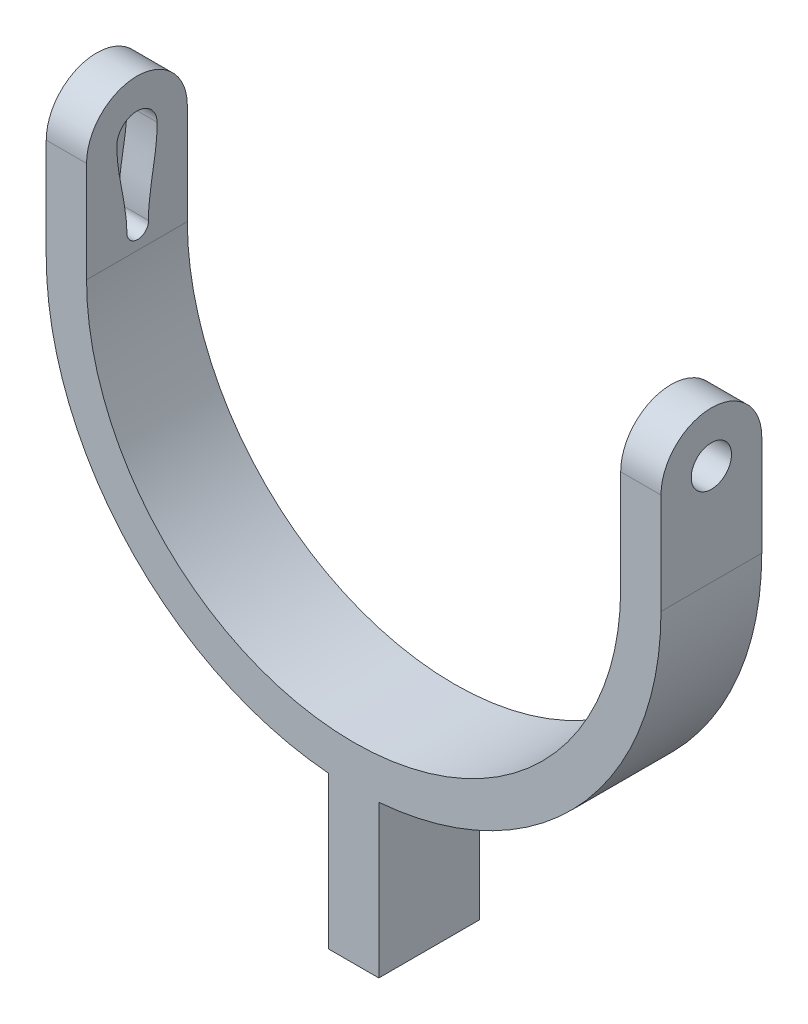
ISO-10303-21;
HEADER;
FILE_DESCRIPTION(('STEP AP214'),'2;1');
FILE_NAME('part.step','',(''),(''),'','','');
FILE_SCHEMA(('AUTOMOTIVE_DESIGN { 1 0 10303 214 1 1 1 1 }'));
ENDSEC;
DATA;
#1=APPLICATION_CONTEXT('core data for automotive mechanical design processes');
#2=APPLICATION_PROTOCOL_DEFINITION('international standard','automotive_design',2000,#1);
#3=PRODUCT_CONTEXT('',#1,'mechanical');
#4=PRODUCT('Part','Part','',(#3));
#5=PRODUCT_RELATED_PRODUCT_CATEGORY('part','',(#4));
#6=PRODUCT_DEFINITION_FORMATION('','',#4);
#7=PRODUCT_DEFINITION_CONTEXT('part definition',#1,'design');
#8=PRODUCT_DEFINITION('design','',#6,#7);
#9=PRODUCT_DEFINITION_SHAPE('','',#8);
#10=(LENGTH_UNIT() NAMED_UNIT(*) SI_UNIT(.MILLI.,.METRE.));
#11=(NAMED_UNIT(*) PLANE_ANGLE_UNIT() SI_UNIT($,.RADIAN.));
#12=(NAMED_UNIT(*) SI_UNIT($,.STERADIAN.) SOLID_ANGLE_UNIT());
#13=UNCERTAINTY_MEASURE_WITH_UNIT(LENGTH_MEASURE(1.E-05),#10,'distance_accuracy_value','');
#14=(GEOMETRIC_REPRESENTATION_CONTEXT(3) GLOBAL_UNCERTAINTY_ASSIGNED_CONTEXT((#13)) GLOBAL_UNIT_ASSIGNED_CONTEXT((#10,
#11,#12)) REPRESENTATION_CONTEXT('',''));
#15=CARTESIAN_POINT('',(0.,0.,0.));
#16=DIRECTION('',(0.,0.,1.));
#17=DIRECTION('',(1.,0.,0.));
#18=AXIS2_PLACEMENT_3D('',#15,#16,#17);
#19=CARTESIAN_POINT('',(-26.5,0.,10.));
#20=DIRECTION('',(-1.,0.,0.));
#21=DIRECTION('',(0.,0.,1.));
#22=AXIS2_PLACEMENT_3D('',#19,#20,#21);
#23=PLANE('',#22);
#24=DIRECTION('',(0.,1.,0.));
#25=VECTOR('',#24,1.);
#26=CARTESIAN_POINT('',(-26.5,0.,0.));
#27=LINE('',#26,#25);
#28=CARTESIAN_POINT('',(-26.5,0.,0.));
#29=VERTEX_POINT('',#28);
#30=CARTESIAN_POINT('',(-26.5,10.,0.));
#31=VERTEX_POINT('',#30);
#32=EDGE_CURVE('E182',#29,#31,#27,.T.);
#33=ORIENTED_EDGE('',*,*,#32,.T.);
#34=CARTESIAN_POINT('',(-26.5,10.,5.));
#35=DIRECTION('',(-1.,0.,0.));
#36=DIRECTION('',(0.,0.,1.));
#37=AXIS2_PLACEMENT_3D('',#34,#35,#36);
#38=CIRCLE('',#37,5.);
#39=CARTESIAN_POINT('',(-26.5,10.,10.));
#40=VERTEX_POINT('',#39);
#41=EDGE_CURVE('E98',#40,#31,#38,.T.);
#42=ORIENTED_EDGE('',*,*,#41,.F.);
#43=DIRECTION('',(0.,1.,0.));
#44=VECTOR('',#43,1.);
#45=CARTESIAN_POINT('',(-26.5,0.,10.));
#46=LINE('',#45,#44);
#47=CARTESIAN_POINT('',(-26.5,0.,10.));
#48=VERTEX_POINT('',#47);
#49=EDGE_CURVE('E153',#48,#40,#46,.T.);
#50=ORIENTED_EDGE('',*,*,#49,.F.);
#51=DIRECTION('',(0.,0.,-1.));
#52=VECTOR('',#51,1.);
#53=CARTESIAN_POINT('',(-26.5,0.,10.));
#54=LINE('',#53,#52);
#55=EDGE_CURVE('E140',#48,#29,#54,.T.);
#56=ORIENTED_EDGE('',*,*,#55,.T.);
#57=EDGE_LOOP('',(#33,#42,#50,#56));
#58=FACE_BOUND('',#57,.T.);
#59=CARTESIAN_POINT('',(-26.5,2.,4.92513040373228));
#60=DIRECTION('',(-1.,0.,0.));
#61=DIRECTION('',(0.,0.,1.));
#62=AXIS2_PLACEMENT_3D('',#59,#60,#61);
#63=CIRCLE('',#62,1.07486959626772);
#64=CARTESIAN_POINT('',(-26.5,2.02011700122553,3.85044907643454));
#65=VERTEX_POINT('',#64);
#66=CARTESIAN_POINT('',(-26.5,2.,6.));
#67=VERTEX_POINT('',#66);
#68=EDGE_CURVE('E478',#65,#67,#63,.T.);
#69=ORIENTED_EDGE('',*,*,#68,.T.);
#70=CARTESIAN_POINT('',(-26.5,10.,7.));
#71=CARTESIAN_POINT('',(-26.5,8.71836656725146,7.));
#72=CARTESIAN_POINT('',(-26.5,6.07475816848907,6.53838546077415));
#73=CARTESIAN_POINT('',(-26.5,3.42216171610132,6.));
#74=CARTESIAN_POINT('',(-26.5,2.,6.));
#75=B_SPLINE_CURVE_WITH_KNOTS('',3,(#70,#71,#72,#73,#74),.UNSPECIFIED.,.F.,.F.,(4,1,4),(0.,
0.472301591176747,1.),.UNSPECIFIED.);
#76=CARTESIAN_POINT('',(-26.5,10.,7.));
#77=VERTEX_POINT('',#76);
#78=EDGE_CURVE('E473',#77,#67,#75,.T.);
#79=ORIENTED_EDGE('',*,*,#78,.F.);
#80=CARTESIAN_POINT('',(-26.5,10.,5.));
#81=DIRECTION('',(-1.,0.,0.));
#82=DIRECTION('',(0.,0.,1.));
#83=AXIS2_PLACEMENT_3D('',#80,#81,#82);
#84=CIRCLE('',#83,2.);
#85=CARTESIAN_POINT('',(-26.5,10.0374315196846,3.00035031034581));
#86=VERTEX_POINT('',#85);
#87=EDGE_CURVE('E505',#77,#86,#84,.T.);
#88=ORIENTED_EDGE('',*,*,#87,.T.);
#89=CARTESIAN_POINT('',(-26.5,10.0374315196846,3.00035031034581));
#90=CARTESIAN_POINT('',(-26.5,8.75602257166156,2.97636356681263));
#91=CARTESIAN_POINT('',(-26.5,6.10423774772948,3.38842011195573));
#92=CARTESIAN_POINT('',(-26.5,3.44202961834557,3.87706591357));
#93=CARTESIAN_POINT('',(-26.5,2.02011700122553,3.85044907643454));
#94=B_SPLINE_CURVE_WITH_KNOTS('',3,(#89,#90,#91,#92,#93),.UNSPECIFIED.,.F.,.F.,(4,1,4),(0.,
0.472301591176748,1.),.UNSPECIFIED.);
#95=EDGE_CURVE('E484',#86,#65,#94,.T.);
#96=ORIENTED_EDGE('',*,*,#95,.T.);
#97=EDGE_LOOP('',(#69,#79,#88,#96));
#98=FACE_BOUND('',#97,.T.);
#99=ADVANCED_FACE('F33',(#58,#98),#23,.F.);
#100=CARTESIAN_POINT('',(-30.5,0.,10.));
#101=DIRECTION('',(-1.,0.,0.));
#102=DIRECTION('',(0.,0.,1.));
#103=AXIS2_PLACEMENT_3D('',#100,#101,#102);
#104=PLANE('',#103);
#105=CARTESIAN_POINT('',(-30.5,10.,5.));
#106=DIRECTION('',(-1.,0.,0.));
#107=DIRECTION('',(0.,0.,1.));
#108=AXIS2_PLACEMENT_3D('',#105,#106,#107);
#109=CIRCLE('',#108,2.);
#110=CARTESIAN_POINT('',(-30.5,10.,7.));
#111=VERTEX_POINT('',#110);
#112=EDGE_CURVE('E251',#111,#111,#109,.T.);
#113=ORIENTED_EDGE('',*,*,#112,.F.);
#114=EDGE_LOOP('',(#113));
#115=FACE_BOUND('',#114,.T.);
#116=DIRECTION('',(0.,1.,0.));
#117=VECTOR('',#116,1.);
#118=CARTESIAN_POINT('',(-30.5,0.,10.));
#119=LINE('',#118,#117);
#120=CARTESIAN_POINT('',(-30.5,0.,10.));
#121=VERTEX_POINT('',#120);
#122=CARTESIAN_POINT('',(-30.5,10.,10.));
#123=VERTEX_POINT('',#122);
#124=EDGE_CURVE('E58',#121,#123,#119,.T.);
#125=ORIENTED_EDGE('',*,*,#124,.T.);
#126=CARTESIAN_POINT('',(-30.5,10.,5.));
#127=DIRECTION('',(-1.,0.,0.));
#128=DIRECTION('',(0.,0.,1.));
#129=AXIS2_PLACEMENT_3D('',#126,#127,#128);
#130=CIRCLE('',#129,5.);
#131=CARTESIAN_POINT('',(-30.5,10.,0.));
#132=VERTEX_POINT('',#131);
#133=EDGE_CURVE('E253',#123,#132,#130,.T.);
#134=ORIENTED_EDGE('',*,*,#133,.T.);
#135=DIRECTION('',(0.,1.,0.));
#136=VECTOR('',#135,1.);
#137=CARTESIAN_POINT('',(-30.5,0.,0.));
#138=LINE('',#137,#136);
#139=CARTESIAN_POINT('',(-30.5,0.,0.));
#140=VERTEX_POINT('',#139);
#141=EDGE_CURVE('E160',#140,#132,#138,.T.);
#142=ORIENTED_EDGE('',*,*,#141,.F.);
#143=DIRECTION('',(0.,0.,-1.));
#144=VECTOR('',#143,1.);
#145=CARTESIAN_POINT('',(-30.5,0.,10.));
#146=LINE('',#145,#144);
#147=EDGE_CURVE('E11',#121,#140,#146,.T.);
#148=ORIENTED_EDGE('',*,*,#147,.F.);
#149=EDGE_LOOP('',(#125,#134,#142,#148));
#150=FACE_BOUND('',#149,.T.);
#151=ADVANCED_FACE('F35',(#115,#150),#104,.T.);
#152=CARTESIAN_POINT('',(0.,0.,10.));
#153=DIRECTION('',(0.,0.,-1.));
#154=DIRECTION('',(-1.,0.,0.));
#155=AXIS2_PLACEMENT_3D('',#152,#153,#154);
#156=CYLINDRICAL_SURFACE('',#155,30.5);
#157=CARTESIAN_POINT('',(0.,0.,0.));
#158=DIRECTION('',(0.,0.,1.));
#159=DIRECTION('',(1.,0.,0.));
#160=AXIS2_PLACEMENT_3D('',#157,#158,#159);
#161=CIRCLE('',#160,30.5);
#162=CARTESIAN_POINT('',(-2.5,-30.3973683071413,0.));
#163=VERTEX_POINT('',#162);
#164=EDGE_CURVE('E163',#140,#163,#161,.T.);
#165=ORIENTED_EDGE('',*,*,#164,.T.);
#166=DIRECTION('',(0.,0.,-1.));
#167=VECTOR('',#166,1.);
#168=CARTESIAN_POINT('',(-2.5,-30.3973683071413,10.));
#169=LINE('',#168,#167);
#170=CARTESIAN_POINT('',(-2.5,-30.3973683071413,10.));
#171=VERTEX_POINT('',#170);
#172=EDGE_CURVE('E42',#171,#163,#169,.T.);
#173=ORIENTED_EDGE('',*,*,#172,.F.);
#174=CARTESIAN_POINT('',(0.,0.,10.));
#175=DIRECTION('',(0.,0.,1.));
#176=DIRECTION('',(1.,0.,0.));
#177=AXIS2_PLACEMENT_3D('',#174,#175,#176);
#178=CIRCLE('',#177,30.5);
#179=EDGE_CURVE('E229',#121,#171,#178,.T.);
#180=ORIENTED_EDGE('',*,*,#179,.F.);
#181=ORIENTED_EDGE('',*,*,#147,.T.);
#182=EDGE_LOOP('',(#165,#173,#180,#181));
#183=FACE_BOUND('',#182,.T.);
#184=ADVANCED_FACE('F255',(#183),#156,.T.);
#185=CARTESIAN_POINT('',(-2.50000000000001,0.,10.));
#186=DIRECTION('',(1.,0.,0.));
#187=DIRECTION('',(0.,1.,0.));
#188=AXIS2_PLACEMENT_3D('',#185,#186,#187);
#189=PLANE('',#188);
#190=DIRECTION('',(0.,-1.,0.));
#191=VECTOR('',#190,1.);
#192=CARTESIAN_POINT('',(-2.50000000000001,0.,0.));
#193=LINE('',#192,#191);
#194=CARTESIAN_POINT('',(-2.5,-45.5,0.));
#195=VERTEX_POINT('',#194);
#196=EDGE_CURVE('E166',#163,#195,#193,.T.);
#197=ORIENTED_EDGE('',*,*,#196,.T.);
#198=DIRECTION('',(0.,0.,-1.));
#199=VECTOR('',#198,1.);
#200=CARTESIAN_POINT('',(-2.5,-45.5,10.));
#201=LINE('',#200,#199);
#202=CARTESIAN_POINT('',(-2.5,-45.5,10.));
#203=VERTEX_POINT('',#202);
#204=EDGE_CURVE('E196',#203,#195,#201,.T.);
#205=ORIENTED_EDGE('',*,*,#204,.F.);
#206=DIRECTION('',(0.,-1.,0.));
#207=VECTOR('',#206,1.);
#208=CARTESIAN_POINT('',(-2.50000000000001,0.,10.));
#209=LINE('',#208,#207);
#210=EDGE_CURVE('E206',#171,#203,#209,.T.);
#211=ORIENTED_EDGE('',*,*,#210,.F.);
#212=ORIENTED_EDGE('',*,*,#172,.T.);
#213=EDGE_LOOP('',(#197,#205,#211,#212));
#214=FACE_BOUND('',#213,.T.);
#215=ADVANCED_FACE('F204',(#214),#189,.F.);
#216=CARTESIAN_POINT('',(0.,-45.5,10.));
#217=DIRECTION('',(0.,1.,0.));
#218=DIRECTION('',(0.,0.,1.));
#219=AXIS2_PLACEMENT_3D('',#216,#217,#218);
#220=PLANE('',#219);
#221=DIRECTION('',(1.,0.,0.));
#222=VECTOR('',#221,1.);
#223=CARTESIAN_POINT('',(0.,-45.5,0.));
#224=LINE('',#223,#222);
#225=CARTESIAN_POINT('',(2.5,-45.5,0.));
#226=VERTEX_POINT('',#225);
#227=EDGE_CURVE('E169',#195,#226,#224,.T.);
#228=ORIENTED_EDGE('',*,*,#227,.T.);
#229=DIRECTION('',(0.,0.,-1.));
#230=VECTOR('',#229,1.);
#231=CARTESIAN_POINT('',(2.5,-45.5,10.));
#232=LINE('',#231,#230);
#233=CARTESIAN_POINT('',(2.5,-45.5,10.));
#234=VERTEX_POINT('',#233);
#235=EDGE_CURVE('E193',#234,#226,#232,.T.);
#236=ORIENTED_EDGE('',*,*,#235,.F.);
#237=DIRECTION('',(1.,0.,0.));
#238=VECTOR('',#237,1.);
#239=CARTESIAN_POINT('',(0.,-45.5,10.));
#240=LINE('',#239,#238);
#241=EDGE_CURVE('E225',#203,#234,#240,.T.);
#242=ORIENTED_EDGE('',*,*,#241,.F.);
#243=ORIENTED_EDGE('',*,*,#204,.T.);
#244=EDGE_LOOP('',(#228,#236,#242,#243));
#245=FACE_BOUND('',#244,.T.);
#246=ADVANCED_FACE('F216',(#245),#220,.F.);
#247=CARTESIAN_POINT('',(2.50000000000001,0.,10.));
#248=DIRECTION('',(-1.,0.,0.));
#249=DIRECTION('',(0.,-1.,0.));
#250=AXIS2_PLACEMENT_3D('',#247,#248,#249);
#251=PLANE('',#250);
#252=DIRECTION('',(0.,1.,0.));
#253=VECTOR('',#252,1.);
#254=CARTESIAN_POINT('',(2.50000000000001,0.,0.));
#255=LINE('',#254,#253);
#256=CARTESIAN_POINT('',(2.5,-30.3973683071413,0.));
#257=VERTEX_POINT('',#256);
#258=EDGE_CURVE('E171',#226,#257,#255,.T.);
#259=ORIENTED_EDGE('',*,*,#258,.T.);
#260=DIRECTION('',(0.,0.,-1.));
#261=VECTOR('',#260,1.);
#262=CARTESIAN_POINT('',(2.5,-30.3973683071413,10.));
#263=LINE('',#262,#261);
#264=CARTESIAN_POINT('',(2.5,-30.3973683071413,10.));
#265=VERTEX_POINT('',#264);
#266=EDGE_CURVE('E190',#265,#257,#263,.T.);
#267=ORIENTED_EDGE('',*,*,#266,.F.);
#268=DIRECTION('',(0.,1.,0.));
#269=VECTOR('',#268,1.);
#270=CARTESIAN_POINT('',(2.50000000000001,0.,10.));
#271=LINE('',#270,#269);
#272=EDGE_CURVE('E222',#234,#265,#271,.T.);
#273=ORIENTED_EDGE('',*,*,#272,.F.);
#274=ORIENTED_EDGE('',*,*,#235,.T.);
#275=EDGE_LOOP('',(#259,#267,#273,#274));
#276=FACE_BOUND('',#275,.T.);
#277=ADVANCED_FACE('F220',(#276),#251,.F.);
#278=CARTESIAN_POINT('',(30.5,0.,0.));
#279=VERTEX_POINT('',#278);
#280=EDGE_CURVE('E167',#257,#279,#161,.T.);
#281=ORIENTED_EDGE('',*,*,#280,.T.);
#282=DIRECTION('',(0.,0.,-1.));
#283=VECTOR('',#282,1.);
#284=CARTESIAN_POINT('',(30.5,0.,10.));
#285=LINE('',#284,#283);
#286=CARTESIAN_POINT('',(30.5,0.,10.));
#287=VERTEX_POINT('',#286);
#288=EDGE_CURVE('E139',#287,#279,#285,.T.);
#289=ORIENTED_EDGE('',*,*,#288,.F.);
#290=EDGE_CURVE('E224',#265,#287,#178,.T.);
#291=ORIENTED_EDGE('',*,*,#290,.F.);
#292=ORIENTED_EDGE('',*,*,#266,.T.);
#293=EDGE_LOOP('',(#281,#289,#291,#292));
#294=FACE_BOUND('',#293,.T.);
#295=ADVANCED_FACE('F258',(#294),#156,.T.);
#296=CARTESIAN_POINT('',(30.5,0.,10.));
#297=DIRECTION('',(-1.,0.,0.));
#298=DIRECTION('',(0.,0.,1.));
#299=AXIS2_PLACEMENT_3D('',#296,#297,#298);
#300=PLANE('',#299);
#301=DIRECTION('',(0.,1.,0.));
#302=VECTOR('',#301,1.);
#303=CARTESIAN_POINT('',(30.5,0.,0.));
#304=LINE('',#303,#302);
#305=CARTESIAN_POINT('',(30.5,10.,0.));
#306=VERTEX_POINT('',#305);
#307=EDGE_CURVE('E173',#279,#306,#304,.T.);
#308=ORIENTED_EDGE('',*,*,#307,.T.);
#309=CARTESIAN_POINT('',(30.5,10.,5.));
#310=DIRECTION('',(1.,0.,0.));
#311=DIRECTION('',(0.,0.,-1.));
#312=AXIS2_PLACEMENT_3D('',#309,#310,#311);
#313=CIRCLE('',#312,5.);
#314=CARTESIAN_POINT('',(30.5,10.,10.));
#315=VERTEX_POINT('',#314);
#316=EDGE_CURVE('E237',#306,#315,#313,.T.);
#317=ORIENTED_EDGE('',*,*,#316,.T.);
#318=DIRECTION('',(0.,1.,0.));
#319=VECTOR('',#318,1.);
#320=CARTESIAN_POINT('',(30.5,0.,10.));
#321=LINE('',#320,#319);
#322=EDGE_CURVE('E227',#287,#315,#321,.T.);
#323=ORIENTED_EDGE('',*,*,#322,.F.);
#324=ORIENTED_EDGE('',*,*,#288,.T.);
#325=EDGE_LOOP('',(#308,#317,#323,#324));
#326=FACE_BOUND('',#325,.T.);
#327=CARTESIAN_POINT('',(30.5,10.,5.));
#328=DIRECTION('',(1.,0.,0.));
#329=DIRECTION('',(0.,0.,-1.));
#330=AXIS2_PLACEMENT_3D('',#327,#328,#329);
#331=CIRCLE('',#330,2.);
#332=CARTESIAN_POINT('',(30.5,10.,3.));
#333=VERTEX_POINT('',#332);
#334=EDGE_CURVE('E37',#333,#333,#331,.T.);
#335=ORIENTED_EDGE('',*,*,#334,.F.);
#336=EDGE_LOOP('',(#335));
#337=FACE_BOUND('',#336,.T.);
#338=ADVANCED_FACE('F242',(#326,#337),#300,.F.);
#339=CARTESIAN_POINT('',(26.5,0.,10.));
#340=DIRECTION('',(-1.,0.,0.));
#341=DIRECTION('',(0.,0.,1.));
#342=AXIS2_PLACEMENT_3D('',#339,#340,#341);
#343=PLANE('',#342);
#344=CARTESIAN_POINT('',(26.5,10.,5.));
#345=DIRECTION('',(-1.,0.,0.));
#346=DIRECTION('',(0.,0.,1.));
#347=AXIS2_PLACEMENT_3D('',#344,#345,#346);
#348=CIRCLE('',#347,2.);
#349=CARTESIAN_POINT('',(26.5,10.,7.));
#350=VERTEX_POINT('',#349);
#351=EDGE_CURVE('E164',#350,#350,#348,.F.);
#352=ORIENTED_EDGE('',*,*,#351,.T.);
#353=EDGE_LOOP('',(#352));
#354=FACE_BOUND('',#353,.T.);
#355=DIRECTION('',(0.,1.,0.));
#356=VECTOR('',#355,1.);
#357=CARTESIAN_POINT('',(26.5,0.,10.));
#358=LINE('',#357,#356);
#359=CARTESIAN_POINT('',(26.5,0.,10.));
#360=VERTEX_POINT('',#359);
#361=CARTESIAN_POINT('',(26.5,10.,10.));
#362=VERTEX_POINT('',#361);
#363=EDGE_CURVE('E131',#360,#362,#358,.T.);
#364=ORIENTED_EDGE('',*,*,#363,.T.);
#365=CARTESIAN_POINT('',(26.5,10.,5.));
#366=DIRECTION('',(-1.,0.,0.));
#367=DIRECTION('',(0.,0.,1.));
#368=AXIS2_PLACEMENT_3D('',#365,#366,#367);
#369=CIRCLE('',#368,5.);
#370=CARTESIAN_POINT('',(26.5,10.,0.));
#371=VERTEX_POINT('',#370);
#372=EDGE_CURVE('E238',#371,#362,#369,.F.);
#373=ORIENTED_EDGE('',*,*,#372,.F.);
#374=DIRECTION('',(0.,1.,0.));
#375=VECTOR('',#374,1.);
#376=CARTESIAN_POINT('',(26.5,0.,0.));
#377=LINE('',#376,#375);
#378=CARTESIAN_POINT('',(26.5,0.,0.));
#379=VERTEX_POINT('',#378);
#380=EDGE_CURVE('E134',#379,#371,#377,.T.);
#381=ORIENTED_EDGE('',*,*,#380,.F.);
#382=DIRECTION('',(0.,0.,-1.));
#383=VECTOR('',#382,1.);
#384=CARTESIAN_POINT('',(26.5,0.,10.));
#385=LINE('',#384,#383);
#386=EDGE_CURVE('E127',#360,#379,#385,.T.);
#387=ORIENTED_EDGE('',*,*,#386,.F.);
#388=EDGE_LOOP('',(#364,#373,#381,#387));
#389=FACE_BOUND('',#388,.T.);
#390=ADVANCED_FACE('F129',(#354,#389),#343,.T.);
#391=CARTESIAN_POINT('',(0.,0.,10.));
#392=DIRECTION('',(0.,0.,-1.));
#393=DIRECTION('',(-1.,0.,0.));
#394=AXIS2_PLACEMENT_3D('',#391,#392,#393);
#395=CYLINDRICAL_SURFACE('',#394,26.5);
#396=CARTESIAN_POINT('',(0.,0.,0.));
#397=DIRECTION('',(0.,0.,1.));
#398=DIRECTION('',(1.,0.,0.));
#399=AXIS2_PLACEMENT_3D('',#396,#397,#398);
#400=CIRCLE('',#399,26.5);
#401=EDGE_CURVE('E180',#29,#379,#400,.T.);
#402=ORIENTED_EDGE('',*,*,#401,.F.);
#403=ORIENTED_EDGE('',*,*,#55,.F.);
#404=CARTESIAN_POINT('',(0.,0.,10.));
#405=DIRECTION('',(0.,0.,1.));
#406=DIRECTION('',(1.,0.,0.));
#407=AXIS2_PLACEMENT_3D('',#404,#405,#406);
#408=CIRCLE('',#407,26.5);
#409=EDGE_CURVE('E146',#48,#360,#408,.T.);
#410=ORIENTED_EDGE('',*,*,#409,.T.);
#411=ORIENTED_EDGE('',*,*,#386,.T.);
#412=EDGE_LOOP('',(#402,#403,#410,#411));
#413=FACE_BOUND('',#412,.T.);
#414=ADVANCED_FACE('F151',(#413),#395,.F.);
#415=CARTESIAN_POINT('',(0.,0.,10.));
#416=DIRECTION('',(0.,0.,1.));
#417=DIRECTION('',(1.,0.,0.));
#418=AXIS2_PLACEMENT_3D('',#415,#416,#417);
#419=PLANE('',#418);
#420=ORIENTED_EDGE('',*,*,#124,.F.);
#421=ORIENTED_EDGE('',*,*,#179,.T.);
#422=ORIENTED_EDGE('',*,*,#210,.T.);
#423=ORIENTED_EDGE('',*,*,#241,.T.);
#424=ORIENTED_EDGE('',*,*,#272,.T.);
#425=ORIENTED_EDGE('',*,*,#290,.T.);
#426=ORIENTED_EDGE('',*,*,#322,.T.);
#427=DIRECTION('',(1.,0.,0.));
#428=VECTOR('',#427,1.);
#429=CARTESIAN_POINT('',(0.,10.,10.));
#430=LINE('',#429,#428);
#431=EDGE_CURVE('E149',#362,#315,#430,.T.);
#432=ORIENTED_EDGE('',*,*,#431,.F.);
#433=ORIENTED_EDGE('',*,*,#363,.F.);
#434=ORIENTED_EDGE('',*,*,#409,.F.);
#435=ORIENTED_EDGE('',*,*,#49,.T.);
#436=DIRECTION('',(1.,0.,0.));
#437=VECTOR('',#436,1.);
#438=CARTESIAN_POINT('',(0.,10.,10.));
#439=LINE('',#438,#437);
#440=EDGE_CURVE('E155',#123,#40,#439,.T.);
#441=ORIENTED_EDGE('',*,*,#440,.F.);
#442=EDGE_LOOP('',(#420,#421,#422,#423,#424,#425,#426,#432,#433,#434,#435,#441));
#443=FACE_BOUND('',#442,.T.);
#444=ADVANCED_FACE('F144',(#443),#419,.T.);
#445=CARTESIAN_POINT('',(0.,0.,0.));
#446=DIRECTION('',(0.,0.,1.));
#447=DIRECTION('',(1.,0.,0.));
#448=AXIS2_PLACEMENT_3D('',#445,#446,#447);
#449=PLANE('',#448);
#450=ORIENTED_EDGE('',*,*,#141,.T.);
#451=DIRECTION('',(1.,0.,0.));
#452=VECTOR('',#451,1.);
#453=CARTESIAN_POINT('',(0.,10.,0.));
#454=LINE('',#453,#452);
#455=EDGE_CURVE('E184',#132,#31,#454,.T.);
#456=ORIENTED_EDGE('',*,*,#455,.T.);
#457=ORIENTED_EDGE('',*,*,#32,.F.);
#458=ORIENTED_EDGE('',*,*,#401,.T.);
#459=ORIENTED_EDGE('',*,*,#380,.T.);
#460=DIRECTION('',(1.,0.,0.));
#461=VECTOR('',#460,1.);
#462=CARTESIAN_POINT('',(0.,10.,0.));
#463=LINE('',#462,#461);
#464=EDGE_CURVE('E176',#371,#306,#463,.T.);
#465=ORIENTED_EDGE('',*,*,#464,.T.);
#466=ORIENTED_EDGE('',*,*,#307,.F.);
#467=ORIENTED_EDGE('',*,*,#280,.F.);
#468=ORIENTED_EDGE('',*,*,#258,.F.);
#469=ORIENTED_EDGE('',*,*,#227,.F.);
#470=ORIENTED_EDGE('',*,*,#196,.F.);
#471=ORIENTED_EDGE('',*,*,#164,.F.);
#472=EDGE_LOOP('',(#450,#456,#457,#458,#459,#465,#466,#467,#468,#469,#470,#471));
#473=FACE_BOUND('',#472,.T.);
#474=ADVANCED_FACE('F211',(#473),#449,.F.);
#475=CARTESIAN_POINT('',(12.357864376269,10.,5.));
#476=DIRECTION('',(1.,0.,0.));
#477=DIRECTION('',(0.,0.,-1.));
#478=AXIS2_PLACEMENT_3D('',#475,#476,#477);
#479=CYLINDRICAL_SURFACE('',#478,5.);
#480=ORIENTED_EDGE('',*,*,#372,.T.);
#481=ORIENTED_EDGE('',*,*,#431,.T.);
#482=ORIENTED_EDGE('',*,*,#316,.F.);
#483=ORIENTED_EDGE('',*,*,#464,.F.);
#484=EDGE_LOOP('',(#480,#481,#482,#483));
#485=FACE_BOUND('',#484,.T.);
#486=ADVANCED_FACE('F235',(#485),#479,.T.);
#487=CARTESIAN_POINT('',(12.357864376269,10.,5.));
#488=DIRECTION('',(1.,0.,0.));
#489=DIRECTION('',(0.,0.,-1.));
#490=AXIS2_PLACEMENT_3D('',#487,#488,#489);
#491=CYLINDRICAL_SURFACE('',#490,2.);
#492=ORIENTED_EDGE('',*,*,#334,.T.);
#493=EDGE_LOOP('',(#492));
#494=FACE_BOUND('',#493,.T.);
#495=ORIENTED_EDGE('',*,*,#351,.F.);
#496=EDGE_LOOP('',(#495));
#497=FACE_BOUND('',#496,.T.);
#498=ADVANCED_FACE('F314',(#494,#497),#491,.F.);
#499=CARTESIAN_POINT('',(-44.642135623731,10.,5.));
#500=DIRECTION('',(1.,0.,0.));
#501=DIRECTION('',(0.,0.,-1.));
#502=AXIS2_PLACEMENT_3D('',#499,#500,#501);
#503=CYLINDRICAL_SURFACE('',#502,5.);
#504=ORIENTED_EDGE('',*,*,#440,.T.);
#505=ORIENTED_EDGE('',*,*,#41,.T.);
#506=ORIENTED_EDGE('',*,*,#455,.F.);
#507=ORIENTED_EDGE('',*,*,#133,.F.);
#508=EDGE_LOOP('',(#504,#505,#506,#507));
#509=FACE_BOUND('',#508,.T.);
#510=ADVANCED_FACE('F320',(#509),#503,.T.);
#511=CARTESIAN_POINT('',(-44.642135623731,10.,5.));
#512=DIRECTION('',(1.,0.,0.));
#513=DIRECTION('',(0.,0.,-1.));
#514=AXIS2_PLACEMENT_3D('',#511,#512,#513);
#515=CYLINDRICAL_SURFACE('',#514,2.);
#516=DIRECTION('',(1.,0.,0.));
#517=VECTOR('',#516,1.);
#518=CARTESIAN_POINT('',(-29.5,10.,7.));
#519=LINE('',#518,#517);
#520=CARTESIAN_POINT('',(-29.5,10.,7.));
#521=VERTEX_POINT('',#520);
#522=EDGE_CURVE('E490',#521,#77,#519,.T.);
#523=ORIENTED_EDGE('',*,*,#522,.F.);
#524=CARTESIAN_POINT('',(-29.5,10.,5.));
#525=DIRECTION('',(-1.,0.,0.));
#526=DIRECTION('',(0.,0.,1.));
#527=AXIS2_PLACEMENT_3D('',#524,#525,#526);
#528=CIRCLE('',#527,2.);
#529=CARTESIAN_POINT('',(-29.5,10.0374315196846,3.00035031034581));
#530=VERTEX_POINT('',#529);
#531=EDGE_CURVE('E465',#530,#521,#528,.T.);
#532=ORIENTED_EDGE('',*,*,#531,.F.);
#533=DIRECTION('',(1.,0.,0.));
#534=VECTOR('',#533,1.);
#535=CARTESIAN_POINT('',(-29.5,10.0374315196846,3.00035031034581));
#536=LINE('',#535,#534);
#537=EDGE_CURVE('E496',#530,#86,#536,.T.);
#538=ORIENTED_EDGE('',*,*,#537,.T.);
#539=ORIENTED_EDGE('',*,*,#87,.F.);
#540=EDGE_LOOP('',(#523,#532,#538,#539));
#541=FACE_BOUND('',#540,.T.);
#542=ORIENTED_EDGE('',*,*,#112,.T.);
#543=EDGE_LOOP('',(#542));
#544=FACE_BOUND('',#543,.T.);
#545=ADVANCED_FACE('F327',(#541,#544),#515,.F.);
#546=CARTESIAN_POINT('',(-29.5,10.,7.));
#547=CARTESIAN_POINT('',(-29.5,8.71836656725146,7.));
#548=CARTESIAN_POINT('',(-29.5,6.07475816848907,6.53838546077415));
#549=CARTESIAN_POINT('',(-29.5,3.42216171610132,6.));
#550=CARTESIAN_POINT('',(-29.5,2.,6.));
#551=B_SPLINE_CURVE_WITH_KNOTS('',3,(#546,#547,#548,#549,#550),.UNSPECIFIED.,.F.,.F.,(4,1,4),
(0.,0.472301591176747,1.),.UNSPECIFIED.);
#552=DIRECTION('',(1.,0.,0.));
#553=VECTOR('',#552,1.);
#554=SURFACE_OF_LINEAR_EXTRUSION('',#551,#553);
#555=ORIENTED_EDGE('',*,*,#78,.T.);
#556=DIRECTION('',(1.,0.,0.));
#557=VECTOR('',#556,1.);
#558=CARTESIAN_POINT('',(-29.5,2.,6.));
#559=LINE('',#558,#557);
#560=CARTESIAN_POINT('',(-29.5,2.,6.));
#561=VERTEX_POINT('',#560);
#562=EDGE_CURVE('E472',#561,#67,#559,.T.);
#563=ORIENTED_EDGE('',*,*,#562,.F.);
#564=EDGE_CURVE('E489',#521,#561,#551,.T.);
#565=ORIENTED_EDGE('',*,*,#564,.F.);
#566=ORIENTED_EDGE('',*,*,#522,.T.);
#567=EDGE_LOOP('',(#555,#563,#565,#566));
#568=FACE_BOUND('',#567,.T.);
#569=ADVANCED_FACE('F334',(#568),#554,.F.);
#570=CARTESIAN_POINT('',(-29.5,10.0374315196846,3.00035031034581));
#571=CARTESIAN_POINT('',(-29.5,8.75602257166156,2.97636356681263));
#572=CARTESIAN_POINT('',(-29.5,6.10423774772948,3.38842011195573));
#573=CARTESIAN_POINT('',(-29.5,3.44202961834557,3.87706591357));
#574=CARTESIAN_POINT('',(-29.5,2.02011700122553,3.85044907643454));
#575=B_SPLINE_CURVE_WITH_KNOTS('',3,(#570,#571,#572,#573,#574),.UNSPECIFIED.,.F.,.F.,(4,1,4),
(0.,0.472301591176748,1.),.UNSPECIFIED.);
#576=DIRECTION('',(1.,0.,0.));
#577=VECTOR('',#576,1.);
#578=SURFACE_OF_LINEAR_EXTRUSION('',#575,#577);
#579=ORIENTED_EDGE('',*,*,#95,.F.);
#580=ORIENTED_EDGE('',*,*,#537,.F.);
#581=CARTESIAN_POINT('',(-29.5,2.02011700122553,3.85044907643454));
#582=VERTEX_POINT('',#581);
#583=EDGE_CURVE('E49',#530,#582,#575,.T.);
#584=ORIENTED_EDGE('',*,*,#583,.T.);
#585=DIRECTION('',(1.,0.,0.));
#586=VECTOR('',#585,1.);
#587=CARTESIAN_POINT('',(-29.5,2.02011700122553,3.85044907643454));
#588=LINE('',#587,#586);
#589=EDGE_CURVE('E499',#582,#65,#588,.T.);
#590=ORIENTED_EDGE('',*,*,#589,.T.);
#591=EDGE_LOOP('',(#579,#580,#584,#590));
#592=FACE_BOUND('',#591,.T.);
#593=ADVANCED_FACE('F342',(#592),#578,.T.);
#594=CARTESIAN_POINT('',(-29.5,2.,4.92513040373228));
#595=DIRECTION('',(1.,0.,0.));
#596=DIRECTION('',(0.,0.,-1.));
#597=AXIS2_PLACEMENT_3D('',#594,#595,#596);
#598=CYLINDRICAL_SURFACE('',#597,1.07486959626772);
#599=ORIENTED_EDGE('',*,*,#68,.F.);
#600=ORIENTED_EDGE('',*,*,#589,.F.);
#601=CARTESIAN_POINT('',(-29.5,2.,4.92513040373228));
#602=DIRECTION('',(-1.,0.,0.));
#603=DIRECTION('',(0.,0.,1.));
#604=AXIS2_PLACEMENT_3D('',#601,#602,#603);
#605=CIRCLE('',#604,1.07486959626772);
#606=EDGE_CURVE('E466',#582,#561,#605,.T.);
#607=ORIENTED_EDGE('',*,*,#606,.T.);
#608=ORIENTED_EDGE('',*,*,#562,.T.);
#609=EDGE_LOOP('',(#599,#600,#607,#608));
#610=FACE_BOUND('',#609,.T.);
#611=ADVANCED_FACE('F350',(#610),#598,.F.);
#612=CARTESIAN_POINT('',(-29.5,5.99915315979091,6.5053288040031));
#613=DIRECTION('',(-1.,0.,0.));
#614=DIRECTION('',(0.,0.,1.));
#615=AXIS2_PLACEMENT_3D('',#612,#613,#614);
#616=PLANE('',#615);
#617=ORIENTED_EDGE('',*,*,#564,.T.);
#618=ORIENTED_EDGE('',*,*,#606,.F.);
#619=ORIENTED_EDGE('',*,*,#583,.F.);
#620=ORIENTED_EDGE('',*,*,#531,.T.);
#621=EDGE_LOOP('',(#617,#618,#619,#620));
#622=FACE_BOUND('',#621,.T.);
#623=ADVANCED_FACE('F358',(#622),#616,.F.);
#624=CLOSED_SHELL('',(#99,#151,#184,#215,#246,#277,#295,#338,#390,#414,#444,#474,#486,#498,#510,
#545,#569,#593,#611,#623));
#625=MANIFOLD_SOLID_BREP('B2',#624);
#626=ADVANCED_BREP_SHAPE_REPRESENTATION('',(#18,#625),#14);
#627=SHAPE_DEFINITION_REPRESENTATION(#9,#626);
ENDSEC;
END-ISO-10303-21;
